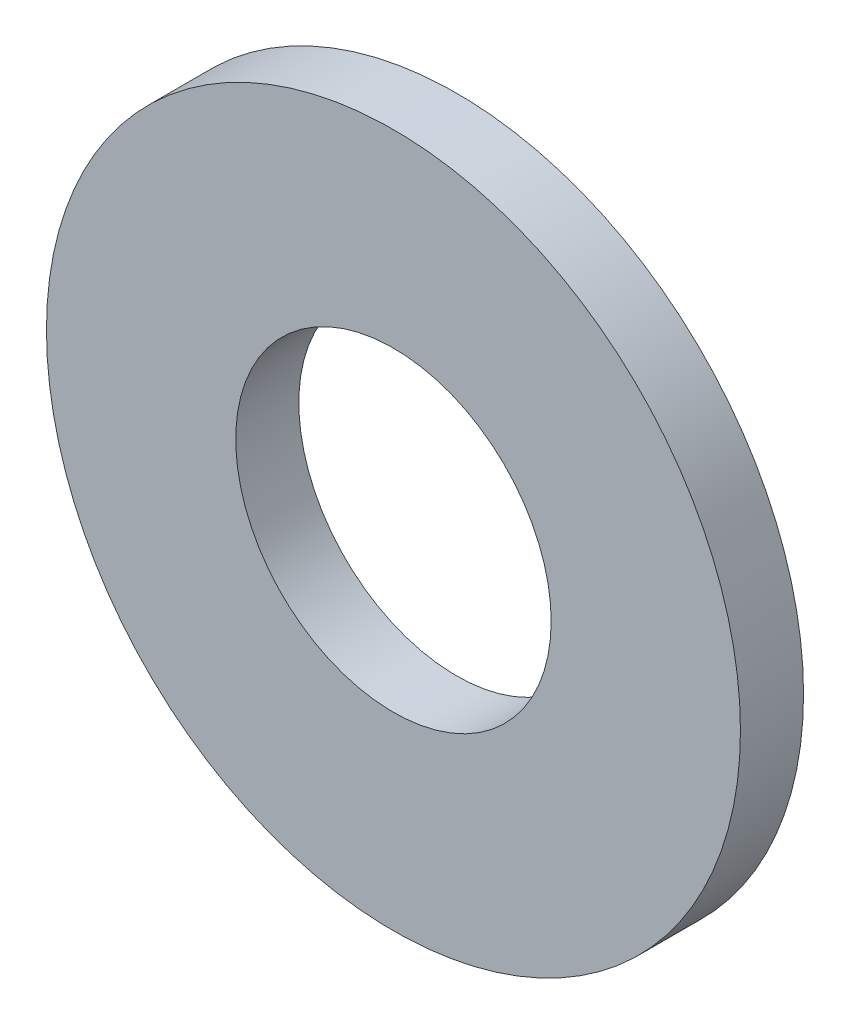
ISO-10303-21;
HEADER;
FILE_DESCRIPTION(('STEP AP214'),'2;1');
FILE_NAME('part.step','',(''),(''),'','','');
FILE_SCHEMA(('AUTOMOTIVE_DESIGN { 1 0 10303 214 1 1 1 1 }'));
ENDSEC;
DATA;
#1=APPLICATION_CONTEXT('core data for automotive mechanical design processes');
#2=APPLICATION_PROTOCOL_DEFINITION('international standard','automotive_design',2000,#1);
#3=PRODUCT_CONTEXT('',#1,'mechanical');
#4=PRODUCT('Part','Part','',(#3));
#5=PRODUCT_RELATED_PRODUCT_CATEGORY('part','',(#4));
#6=PRODUCT_DEFINITION_FORMATION('','',#4);
#7=PRODUCT_DEFINITION_CONTEXT('part definition',#1,'design');
#8=PRODUCT_DEFINITION('design','',#6,#7);
#9=PRODUCT_DEFINITION_SHAPE('','',#8);
#10=(LENGTH_UNIT() NAMED_UNIT(*) SI_UNIT(.MILLI.,.METRE.));
#11=(NAMED_UNIT(*) PLANE_ANGLE_UNIT() SI_UNIT($,.RADIAN.));
#12=(NAMED_UNIT(*) SI_UNIT($,.STERADIAN.) SOLID_ANGLE_UNIT());
#13=UNCERTAINTY_MEASURE_WITH_UNIT(LENGTH_MEASURE(1.E-05),#10,'distance_accuracy_value','');
#14=(GEOMETRIC_REPRESENTATION_CONTEXT(3) GLOBAL_UNCERTAINTY_ASSIGNED_CONTEXT((#13)) GLOBAL_UNIT_ASSIGNED_CONTEXT((#10,
#11,#12)) REPRESENTATION_CONTEXT('',''));
#15=CARTESIAN_POINT('',(0.,0.,0.));
#16=DIRECTION('',(0.,0.,1.));
#17=DIRECTION('',(1.,0.,0.));
#18=AXIS2_PLACEMENT_3D('',#15,#16,#17);
#19=CARTESIAN_POINT('',(0.,0.,2.));
#20=DIRECTION('',(0.,0.,1.));
#21=DIRECTION('',(1.,0.,0.));
#22=AXIS2_PLACEMENT_3D('',#19,#20,#21);
#23=PLANE('',#22);
#24=CARTESIAN_POINT('',(0.,0.,2.));
#25=DIRECTION('',(0.,0.,1.));
#26=DIRECTION('',(1.,0.,0.));
#27=AXIS2_PLACEMENT_3D('',#24,#25,#26);
#28=CIRCLE('',#27,11.);
#29=CARTESIAN_POINT('',(11.,0.,2.));
#30=VERTEX_POINT('',#29);
#31=EDGE_CURVE('E10',#30,#30,#28,.T.);
#32=ORIENTED_EDGE('',*,*,#31,.T.);
#33=EDGE_LOOP('',(#32));
#34=FACE_BOUND('',#33,.T.);
#35=CARTESIAN_POINT('',(0.,0.,2.));
#36=DIRECTION('',(0.,0.,1.));
#37=DIRECTION('',(1.,0.,0.));
#38=AXIS2_PLACEMENT_3D('',#35,#36,#37);
#39=CIRCLE('',#38,5.);
#40=CARTESIAN_POINT('',(5.,0.,2.));
#41=VERTEX_POINT('',#40);
#42=EDGE_CURVE('E42',#41,#41,#39,.T.);
#43=ORIENTED_EDGE('',*,*,#42,.F.);
#44=EDGE_LOOP('',(#43));
#45=FACE_BOUND('',#44,.T.);
#46=ADVANCED_FACE('F31',(#34,#45),#23,.T.);
#47=CARTESIAN_POINT('',(0.,0.,0.));
#48=DIRECTION('',(0.,0.,1.));
#49=DIRECTION('',(1.,0.,0.));
#50=AXIS2_PLACEMENT_3D('',#47,#48,#49);
#51=PLANE('',#50);
#52=CARTESIAN_POINT('',(0.,0.,0.));
#53=DIRECTION('',(0.,0.,1.));
#54=DIRECTION('',(1.,0.,0.));
#55=AXIS2_PLACEMENT_3D('',#52,#53,#54);
#56=CIRCLE('',#55,11.);
#57=CARTESIAN_POINT('',(11.,0.,0.));
#58=VERTEX_POINT('',#57);
#59=EDGE_CURVE('E35',#58,#58,#56,.T.);
#60=ORIENTED_EDGE('',*,*,#59,.F.);
#61=EDGE_LOOP('',(#60));
#62=FACE_BOUND('',#61,.T.);
#63=CARTESIAN_POINT('',(0.,0.,0.));
#64=DIRECTION('',(0.,0.,1.));
#65=DIRECTION('',(1.,0.,0.));
#66=AXIS2_PLACEMENT_3D('',#63,#64,#65);
#67=CIRCLE('',#66,5.);
#68=CARTESIAN_POINT('',(5.,0.,0.));
#69=VERTEX_POINT('',#68);
#70=EDGE_CURVE('E44',#69,#69,#67,.T.);
#71=ORIENTED_EDGE('',*,*,#70,.T.);
#72=EDGE_LOOP('',(#71));
#73=FACE_BOUND('',#72,.T.);
#74=ADVANCED_FACE('F54',(#62,#73),#51,.F.);
#75=CARTESIAN_POINT('',(0.,0.,2.));
#76=DIRECTION('',(0.,0.,-1.));
#77=DIRECTION('',(-1.,0.,0.));
#78=AXIS2_PLACEMENT_3D('',#75,#76,#77);
#79=CYLINDRICAL_SURFACE('',#78,11.);
#80=ORIENTED_EDGE('',*,*,#31,.F.);
#81=EDGE_LOOP('',(#80));
#82=FACE_BOUND('',#81,.T.);
#83=ORIENTED_EDGE('',*,*,#59,.T.);
#84=EDGE_LOOP('',(#83));
#85=FACE_BOUND('',#84,.T.);
#86=ADVANCED_FACE('F33',(#82,#85),#79,.T.);
#87=CARTESIAN_POINT('',(0.,0.,2.));
#88=DIRECTION('',(0.,0.,-1.));
#89=DIRECTION('',(-1.,0.,0.));
#90=AXIS2_PLACEMENT_3D('',#87,#88,#89);
#91=CYLINDRICAL_SURFACE('',#90,5.);
#92=ORIENTED_EDGE('',*,*,#42,.T.);
#93=EDGE_LOOP('',(#92));
#94=FACE_BOUND('',#93,.T.);
#95=ORIENTED_EDGE('',*,*,#70,.F.);
#96=EDGE_LOOP('',(#95));
#97=FACE_BOUND('',#96,.T.);
#98=ADVANCED_FACE('F50',(#94,#97),#91,.F.);
#99=CLOSED_SHELL('',(#46,#74,#86,#98));
#100=MANIFOLD_SOLID_BREP('B2',#99);
#101=ADVANCED_BREP_SHAPE_REPRESENTATION('',(#18,#100),#14);
#102=SHAPE_DEFINITION_REPRESENTATION(#9,#101);
ENDSEC;
END-ISO-10303-21;
